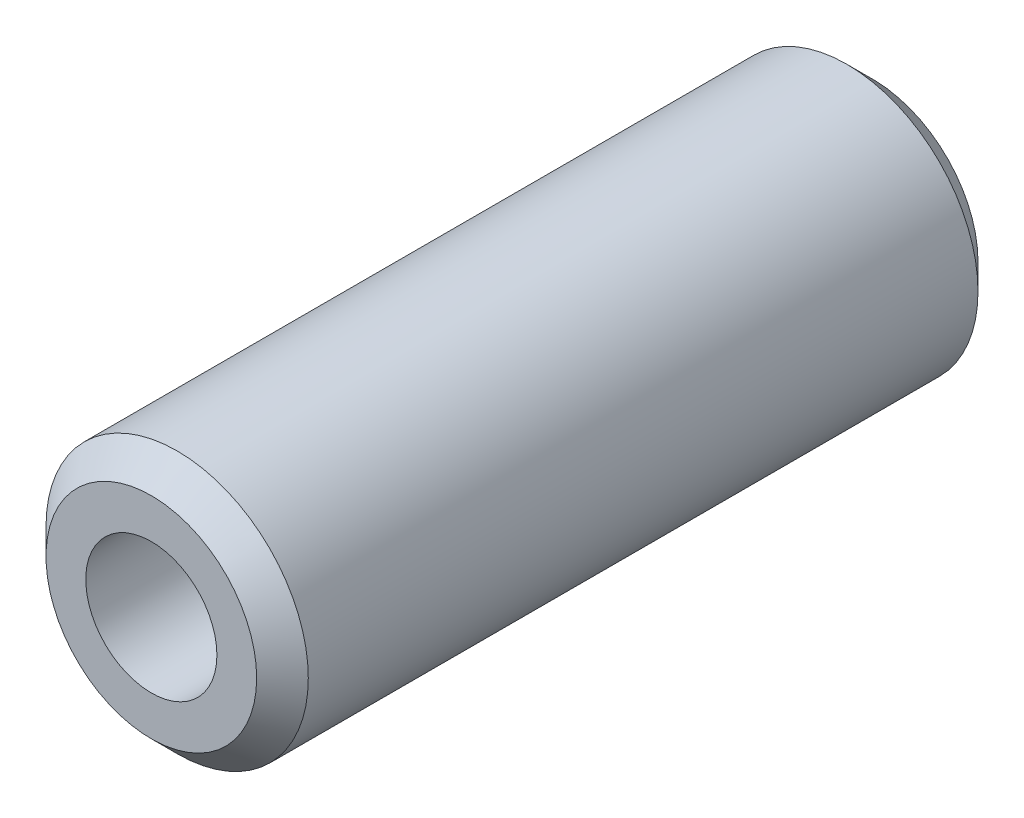
ISO-10303-21;
HEADER;
FILE_DESCRIPTION(('STEP AP214'),'2;1');
FILE_NAME('part.step','',(''),(''),'','','');
FILE_SCHEMA(('AUTOMOTIVE_DESIGN { 1 0 10303 214 1 1 1 1 }'));
ENDSEC;
DATA;
#1=APPLICATION_CONTEXT('core data for automotive mechanical design processes');
#2=APPLICATION_PROTOCOL_DEFINITION('international standard','automotive_design',2000,#1);
#3=PRODUCT_CONTEXT('',#1,'mechanical');
#4=PRODUCT('Part','Part','',(#3));
#5=PRODUCT_RELATED_PRODUCT_CATEGORY('part','',(#4));
#6=PRODUCT_DEFINITION_FORMATION('','',#4);
#7=PRODUCT_DEFINITION_CONTEXT('part definition',#1,'design');
#8=PRODUCT_DEFINITION('design','',#6,#7);
#9=PRODUCT_DEFINITION_SHAPE('','',#8);
#10=(LENGTH_UNIT() NAMED_UNIT(*) SI_UNIT(.MILLI.,.METRE.));
#11=(NAMED_UNIT(*) PLANE_ANGLE_UNIT() SI_UNIT($,.RADIAN.));
#12=(NAMED_UNIT(*) SI_UNIT($,.STERADIAN.) SOLID_ANGLE_UNIT());
#13=UNCERTAINTY_MEASURE_WITH_UNIT(LENGTH_MEASURE(1.E-05),#10,'distance_accuracy_value','');
#14=(GEOMETRIC_REPRESENTATION_CONTEXT(3) GLOBAL_UNCERTAINTY_ASSIGNED_CONTEXT((#13)) GLOBAL_UNIT_ASSIGNED_CONTEXT((#10,
#11,#12)) REPRESENTATION_CONTEXT('',''));
#15=CARTESIAN_POINT('',(0.,0.,0.));
#16=DIRECTION('',(0.,0.,1.));
#17=DIRECTION('',(1.,0.,0.));
#18=AXIS2_PLACEMENT_3D('',#15,#16,#17);
#19=CARTESIAN_POINT('',(0.,0.,34.925));
#20=DIRECTION('',(0.,0.,1.));
#21=DIRECTION('',(1.,0.,0.));
#22=AXIS2_PLACEMENT_3D('',#19,#20,#21);
#23=PLANE('',#22);
#24=CARTESIAN_POINT('',(0.,0.,34.925));
#25=DIRECTION('',(0.,0.,1.));
#26=DIRECTION('',(1.,0.,0.));
#27=AXIS2_PLACEMENT_3D('',#24,#25,#26);
#28=CIRCLE('',#27,10.2);
#29=CARTESIAN_POINT('',(10.2,0.,34.925));
#30=VERTEX_POINT('',#29);
#31=EDGE_CURVE('E10',#30,#30,#28,.T.);
#32=ORIENTED_EDGE('',*,*,#31,.T.);
#33=EDGE_LOOP('',(#32));
#34=FACE_BOUND('',#33,.T.);
#35=CARTESIAN_POINT('',(0.,0.,34.925));
#36=DIRECTION('',(0.,0.,1.));
#37=DIRECTION('',(1.,0.,0.));
#38=AXIS2_PLACEMENT_3D('',#35,#36,#37);
#39=CIRCLE('',#38,6.35);
#40=CARTESIAN_POINT('',(6.35,0.,34.925));
#41=VERTEX_POINT('',#40);
#42=EDGE_CURVE('E68',#41,#41,#39,.T.);
#43=ORIENTED_EDGE('',*,*,#42,.F.);
#44=EDGE_LOOP('',(#43));
#45=FACE_BOUND('',#44,.T.);
#46=ADVANCED_FACE('F43',(#34,#45),#23,.T.);
#47=CARTESIAN_POINT('',(0.,0.,-34.925));
#48=DIRECTION('',(0.,0.,1.));
#49=DIRECTION('',(1.,0.,0.));
#50=AXIS2_PLACEMENT_3D('',#47,#48,#49);
#51=PLANE('',#50);
#52=CARTESIAN_POINT('',(0.,0.,-34.925));
#53=DIRECTION('',(0.,0.,1.));
#54=DIRECTION('',(1.,0.,0.));
#55=AXIS2_PLACEMENT_3D('',#52,#53,#54);
#56=CIRCLE('',#55,10.2);
#57=CARTESIAN_POINT('',(10.2,0.,-34.925));
#58=VERTEX_POINT('',#57);
#59=EDGE_CURVE('E52',#58,#58,#56,.F.);
#60=ORIENTED_EDGE('',*,*,#59,.T.);
#61=EDGE_LOOP('',(#60));
#62=FACE_BOUND('',#61,.T.);
#63=CARTESIAN_POINT('',(0.,0.,-34.925));
#64=DIRECTION('',(0.,0.,1.));
#65=DIRECTION('',(1.,0.,0.));
#66=AXIS2_PLACEMENT_3D('',#63,#64,#65);
#67=CIRCLE('',#66,6.35);
#68=CARTESIAN_POINT('',(6.35,0.,-34.925));
#69=VERTEX_POINT('',#68);
#70=EDGE_CURVE('E69',#69,#69,#67,.T.);
#71=ORIENTED_EDGE('',*,*,#70,.T.);
#72=EDGE_LOOP('',(#71));
#73=FACE_BOUND('',#72,.T.);
#74=ADVANCED_FACE('F81',(#62,#73),#51,.F.);
#75=CARTESIAN_POINT('',(0.,0.,34.925));
#76=DIRECTION('',(0.,0.,-1.));
#77=DIRECTION('',(-1.,0.,0.));
#78=AXIS2_PLACEMENT_3D('',#75,#76,#77);
#79=CYLINDRICAL_SURFACE('',#78,12.7);
#80=CARTESIAN_POINT('',(0.,0.,-32.425));
#81=DIRECTION('',(0.,0.,1.));
#82=DIRECTION('',(1.,0.,0.));
#83=AXIS2_PLACEMENT_3D('',#80,#81,#82);
#84=CIRCLE('',#83,12.7);
#85=CARTESIAN_POINT('',(12.7,0.,-32.425));
#86=VERTEX_POINT('',#85);
#87=EDGE_CURVE('E57',#86,#86,#84,.T.);
#88=ORIENTED_EDGE('',*,*,#87,.T.);
#89=EDGE_LOOP('',(#88));
#90=FACE_BOUND('',#89,.T.);
#91=CARTESIAN_POINT('',(0.,0.,32.425));
#92=DIRECTION('',(0.,0.,1.));
#93=DIRECTION('',(1.,0.,0.));
#94=AXIS2_PLACEMENT_3D('',#91,#92,#93);
#95=CIRCLE('',#94,12.7);
#96=CARTESIAN_POINT('',(12.7,0.,32.425));
#97=VERTEX_POINT('',#96);
#98=EDGE_CURVE('E62',#97,#97,#95,.F.);
#99=ORIENTED_EDGE('',*,*,#98,.T.);
#100=EDGE_LOOP('',(#99));
#101=FACE_BOUND('',#100,.T.);
#102=ADVANCED_FACE('F86',(#90,#101),#79,.T.);
#103=CARTESIAN_POINT('',(0.,0.,34.925));
#104=DIRECTION('',(0.,0.,-1.));
#105=DIRECTION('',(-1.,0.,0.));
#106=AXIS2_PLACEMENT_3D('',#103,#104,#105);
#107=CYLINDRICAL_SURFACE('',#106,6.35);
#108=ORIENTED_EDGE('',*,*,#42,.T.);
#109=EDGE_LOOP('',(#108));
#110=FACE_BOUND('',#109,.T.);
#111=ORIENTED_EDGE('',*,*,#70,.F.);
#112=EDGE_LOOP('',(#111));
#113=FACE_BOUND('',#112,.T.);
#114=ADVANCED_FACE('F77',(#110,#113),#107,.F.);
#115=CARTESIAN_POINT('',(0.,0.,-32.425));
#116=DIRECTION('',(0.,0.,1.));
#117=DIRECTION('',(1.,0.,0.));
#118=AXIS2_PLACEMENT_3D('',#115,#116,#117);
#119=CONICAL_SURFACE('',#118,12.7,0.785398163397449);
#120=ORIENTED_EDGE('',*,*,#59,.F.);
#121=EDGE_LOOP('',(#120));
#122=FACE_BOUND('',#121,.T.);
#123=ORIENTED_EDGE('',*,*,#87,.F.);
#124=EDGE_LOOP('',(#123));
#125=FACE_BOUND('',#124,.T.);
#126=ADVANCED_FACE('F93',(#122,#125),#119,.T.);
#127=CARTESIAN_POINT('',(0.,0.,34.925));
#128=DIRECTION('',(0.,0.,-1.));
#129=DIRECTION('',(-1.,0.,0.));
#130=AXIS2_PLACEMENT_3D('',#127,#128,#129);
#131=CONICAL_SURFACE('',#130,10.2,0.785398163397446);
#132=ORIENTED_EDGE('',*,*,#98,.F.);
#133=EDGE_LOOP('',(#132));
#134=FACE_BOUND('',#133,.T.);
#135=ORIENTED_EDGE('',*,*,#31,.F.);
#136=EDGE_LOOP('',(#135));
#137=FACE_BOUND('',#136,.T.);
#138=ADVANCED_FACE('F46',(#134,#137),#131,.T.);
#139=CLOSED_SHELL('',(#46,#74,#102,#114,#126,#138));
#140=MANIFOLD_SOLID_BREP('B2',#139);
#141=ADVANCED_BREP_SHAPE_REPRESENTATION('',(#18,#140),#14);
#142=SHAPE_DEFINITION_REPRESENTATION(#9,#141);
ENDSEC;
END-ISO-10303-21;
